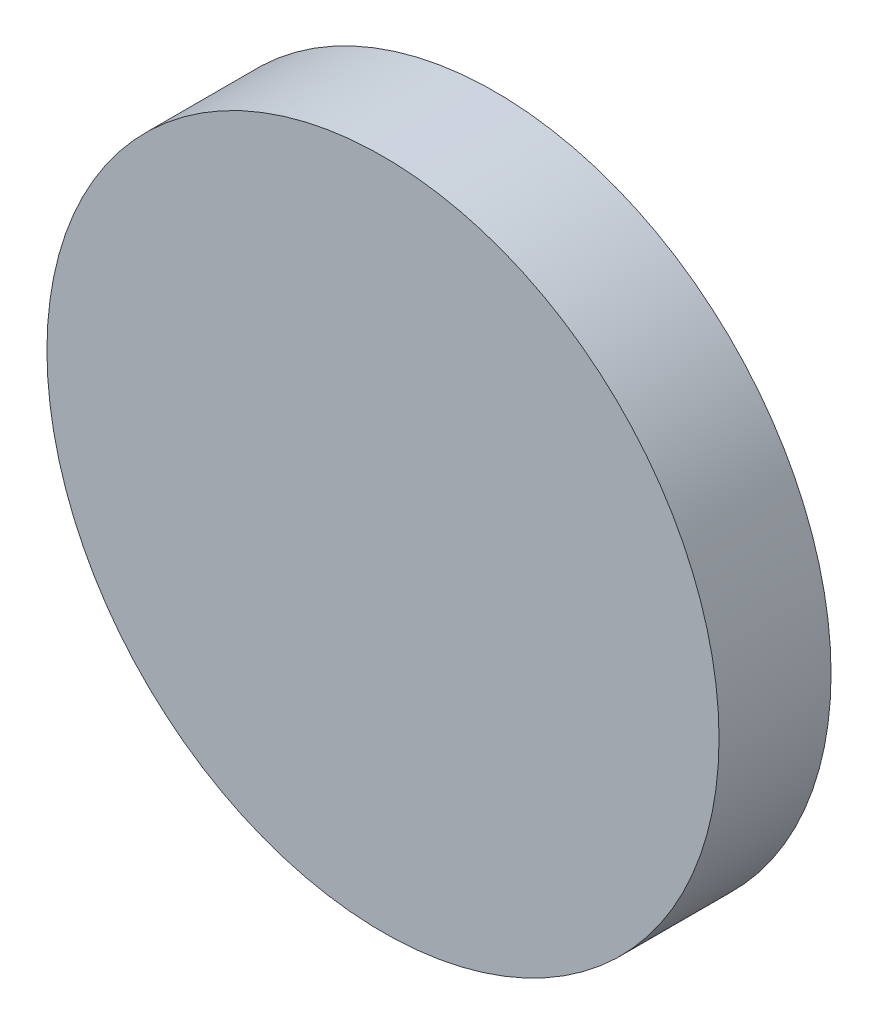
ISO-10303-21;
HEADER;
FILE_DESCRIPTION(('STEP AP214'),'2;1');
FILE_NAME('part.step','',(''),(''),'','','');
FILE_SCHEMA(('AUTOMOTIVE_DESIGN { 1 0 10303 214 1 1 1 1 }'));
ENDSEC;
DATA;
#1=APPLICATION_CONTEXT('core data for automotive mechanical design processes');
#2=APPLICATION_PROTOCOL_DEFINITION('international standard','automotive_design',2000,#1);
#3=PRODUCT_CONTEXT('',#1,'mechanical');
#4=PRODUCT('Part','Part','',(#3));
#5=PRODUCT_RELATED_PRODUCT_CATEGORY('part','',(#4));
#6=PRODUCT_DEFINITION_FORMATION('','',#4);
#7=PRODUCT_DEFINITION_CONTEXT('part definition',#1,'design');
#8=PRODUCT_DEFINITION('design','',#6,#7);
#9=PRODUCT_DEFINITION_SHAPE('','',#8);
#10=(LENGTH_UNIT() NAMED_UNIT(*) SI_UNIT(.MILLI.,.METRE.));
#11=(NAMED_UNIT(*) PLANE_ANGLE_UNIT() SI_UNIT($,.RADIAN.));
#12=(NAMED_UNIT(*) SI_UNIT($,.STERADIAN.) SOLID_ANGLE_UNIT());
#13=UNCERTAINTY_MEASURE_WITH_UNIT(LENGTH_MEASURE(1.E-05),#10,'distance_accuracy_value','');
#14=(GEOMETRIC_REPRESENTATION_CONTEXT(3) GLOBAL_UNCERTAINTY_ASSIGNED_CONTEXT((#13)) GLOBAL_UNIT_ASSIGNED_CONTEXT((#10,
#11,#12)) REPRESENTATION_CONTEXT('',''));
#15=CARTESIAN_POINT('',(0.,0.,0.));
#16=DIRECTION('',(0.,0.,1.));
#17=DIRECTION('',(1.,0.,0.));
#18=AXIS2_PLACEMENT_3D('',#15,#16,#17);
#19=CARTESIAN_POINT('',(0.,0.,1.));
#20=DIRECTION('',(0.,0.,-1.));
#21=DIRECTION('',(-1.,0.,0.));
#22=AXIS2_PLACEMENT_3D('',#19,#20,#21);
#23=CYLINDRICAL_SURFACE('',#22,3.);
#24=CARTESIAN_POINT('',(0.,0.,1.));
#25=DIRECTION('',(0.,0.,1.));
#26=DIRECTION('',(1.,0.,0.));
#27=AXIS2_PLACEMENT_3D('',#24,#25,#26);
#28=CIRCLE('',#27,3.);
#29=CARTESIAN_POINT('',(3.,0.,1.));
#30=VERTEX_POINT('',#29);
#31=EDGE_CURVE('E10',#30,#30,#28,.T.);
#32=ORIENTED_EDGE('',*,*,#31,.F.);
#33=EDGE_LOOP('',(#32));
#34=FACE_BOUND('',#33,.T.);
#35=CARTESIAN_POINT('',(0.,0.,0.));
#36=DIRECTION('',(0.,0.,1.));
#37=DIRECTION('',(1.,0.,0.));
#38=AXIS2_PLACEMENT_3D('',#35,#36,#37);
#39=CIRCLE('',#38,3.);
#40=CARTESIAN_POINT('',(3.,0.,0.));
#41=VERTEX_POINT('',#40);
#42=EDGE_CURVE('E34',#41,#41,#39,.T.);
#43=ORIENTED_EDGE('',*,*,#42,.T.);
#44=EDGE_LOOP('',(#43));
#45=FACE_BOUND('',#44,.T.);
#46=ADVANCED_FACE('F31',(#34,#45),#23,.T.);
#47=CARTESIAN_POINT('',(0.,0.,1.));
#48=DIRECTION('',(0.,0.,1.));
#49=DIRECTION('',(1.,0.,0.));
#50=AXIS2_PLACEMENT_3D('',#47,#48,#49);
#51=PLANE('',#50);
#52=ORIENTED_EDGE('',*,*,#31,.T.);
#53=EDGE_LOOP('',(#52));
#54=FACE_BOUND('',#53,.T.);
#55=ADVANCED_FACE('F46',(#54),#51,.T.);
#56=CARTESIAN_POINT('',(0.,0.,0.));
#57=DIRECTION('',(0.,0.,1.));
#58=DIRECTION('',(1.,0.,0.));
#59=AXIS2_PLACEMENT_3D('',#56,#57,#58);
#60=PLANE('',#59);
#61=ORIENTED_EDGE('',*,*,#42,.F.);
#62=EDGE_LOOP('',(#61));
#63=FACE_BOUND('',#62,.T.);
#64=ADVANCED_FACE('F44',(#63),#60,.F.);
#65=CLOSED_SHELL('',(#46,#55,#64));
#66=MANIFOLD_SOLID_BREP('B2',#65);
#67=ADVANCED_BREP_SHAPE_REPRESENTATION('',(#18,#66),#14);
#68=SHAPE_DEFINITION_REPRESENTATION(#9,#67);
ENDSEC;
END-ISO-10303-21;
